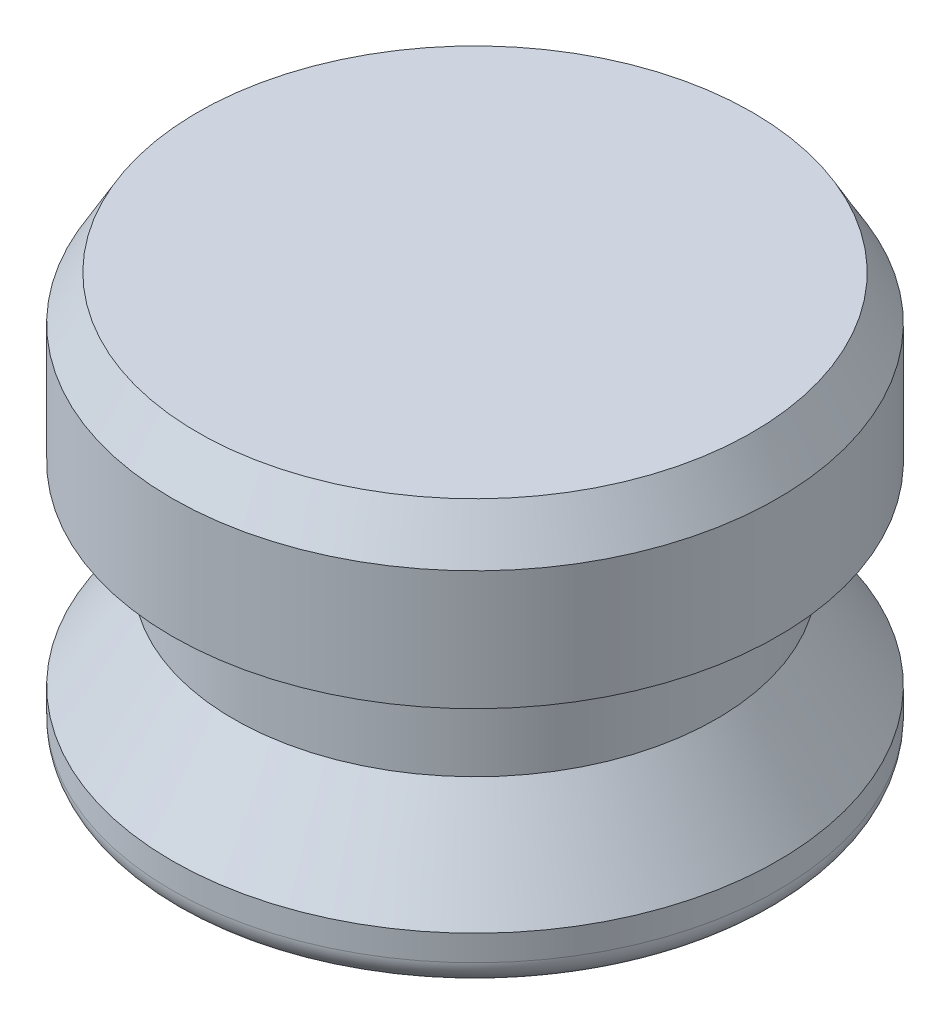
ISO-10303-21;
HEADER;
FILE_DESCRIPTION(('STEP AP214'),'2;1');
FILE_NAME('part.step','',(''),(''),'','','');
FILE_SCHEMA(('AUTOMOTIVE_DESIGN { 1 0 10303 214 1 1 1 1 }'));
ENDSEC;
DATA;
#1=APPLICATION_CONTEXT('core data for automotive mechanical design processes');
#2=APPLICATION_PROTOCOL_DEFINITION('international standard','automotive_design',2000,#1);
#3=PRODUCT_CONTEXT('',#1,'mechanical');
#4=PRODUCT('Part','Part','',(#3));
#5=PRODUCT_RELATED_PRODUCT_CATEGORY('part','',(#4));
#6=PRODUCT_DEFINITION_FORMATION('','',#4);
#7=PRODUCT_DEFINITION_CONTEXT('part definition',#1,'design');
#8=PRODUCT_DEFINITION('design','',#6,#7);
#9=PRODUCT_DEFINITION_SHAPE('','',#8);
#10=(LENGTH_UNIT() NAMED_UNIT(*) SI_UNIT(.MILLI.,.METRE.));
#11=(NAMED_UNIT(*) PLANE_ANGLE_UNIT() SI_UNIT($,.RADIAN.));
#12=(NAMED_UNIT(*) SI_UNIT($,.STERADIAN.) SOLID_ANGLE_UNIT());
#13=UNCERTAINTY_MEASURE_WITH_UNIT(LENGTH_MEASURE(1.E-05),#10,'distance_accuracy_value','');
#14=(GEOMETRIC_REPRESENTATION_CONTEXT(3) GLOBAL_UNCERTAINTY_ASSIGNED_CONTEXT((#13)) GLOBAL_UNIT_ASSIGNED_CONTEXT((#10,
#11,#12)) REPRESENTATION_CONTEXT('',''));
#15=CARTESIAN_POINT('',(0.,0.,0.));
#16=DIRECTION('',(0.,0.,1.));
#17=DIRECTION('',(1.,0.,0.));
#18=AXIS2_PLACEMENT_3D('',#15,#16,#17);
#19=CARTESIAN_POINT('',(0.,0.,0.));
#20=DIRECTION('',(0.,1.,0.));
#21=DIRECTION('',(0.,0.,1.));
#22=AXIS2_PLACEMENT_3D('',#19,#20,#21);
#23=PLANE('',#22);
#24=CARTESIAN_POINT('',(0.,0.,0.));
#25=DIRECTION('',(0.,1.,0.));
#26=DIRECTION('',(0.,0.,1.));
#27=AXIS2_PLACEMENT_3D('',#24,#25,#26);
#28=CIRCLE('',#27,8.60425);
#29=CARTESIAN_POINT('',(0.,0.,8.60425));
#30=VERTEX_POINT('',#29);
#31=EDGE_CURVE('E46',#30,#30,#28,.F.);
#32=ORIENTED_EDGE('',*,*,#31,.T.);
#33=EDGE_LOOP('',(#32));
#34=FACE_BOUND('',#33,.T.);
#35=ADVANCED_FACE('F31',(#34),#23,.F.);
#36=CARTESIAN_POINT('',(0.,0.,0.));
#37=DIRECTION('',(0.,-1.,0.));
#38=DIRECTION('',(0.,0.,-1.));
#39=AXIS2_PLACEMENT_3D('',#36,#37,#38);
#40=CYLINDRICAL_SURFACE('',#39,9.398);
#41=CARTESIAN_POINT('',(0.,0.793749999999999,0.));
#42=DIRECTION('',(0.,1.,0.));
#43=DIRECTION('',(0.,0.,1.));
#44=AXIS2_PLACEMENT_3D('',#41,#42,#43);
#45=CIRCLE('',#44,9.398);
#46=CARTESIAN_POINT('',(0.,0.793749999999999,9.398));
#47=VERTEX_POINT('',#46);
#48=EDGE_CURVE('E42',#47,#47,#45,.T.);
#49=ORIENTED_EDGE('',*,*,#48,.T.);
#50=EDGE_LOOP('',(#49));
#51=FACE_BOUND('',#50,.T.);
#52=CARTESIAN_POINT('',(0.,1.5875,0.));
#53=DIRECTION('',(0.,-1.,0.));
#54=DIRECTION('',(0.,0.,-1.));
#55=AXIS2_PLACEMENT_3D('',#52,#53,#54);
#56=CIRCLE('',#55,9.398);
#57=CARTESIAN_POINT('',(0.,1.5875,-9.398));
#58=VERTEX_POINT('',#57);
#59=EDGE_CURVE('E51',#58,#58,#56,.T.);
#60=ORIENTED_EDGE('',*,*,#59,.T.);
#61=EDGE_LOOP('',(#60));
#62=FACE_BOUND('',#61,.T.);
#63=ADVANCED_FACE('F80',(#51,#62),#40,.T.);
#64=CARTESIAN_POINT('',(0.,4.445,0.));
#65=DIRECTION('',(0.,-1.,0.));
#66=DIRECTION('',(0.,0.,-1.));
#67=AXIS2_PLACEMENT_3D('',#64,#65,#66);
#68=CONICAL_SURFACE('',#67,7.493,0.588002603547568);
#69=ORIENTED_EDGE('',*,*,#59,.F.);
#70=EDGE_LOOP('',(#69));
#71=FACE_BOUND('',#70,.T.);
#72=CARTESIAN_POINT('',(0.,4.445,0.));
#73=DIRECTION('',(0.,-1.,0.));
#74=DIRECTION('',(0.,0.,-1.));
#75=AXIS2_PLACEMENT_3D('',#72,#73,#74);
#76=CIRCLE('',#75,7.493);
#77=CARTESIAN_POINT('',(0.,4.445,-7.493));
#78=VERTEX_POINT('',#77);
#79=EDGE_CURVE('E54',#78,#78,#76,.T.);
#80=ORIENTED_EDGE('',*,*,#79,.T.);
#81=EDGE_LOOP('',(#80));
#82=FACE_BOUND('',#81,.T.);
#83=ADVANCED_FACE('F86',(#71,#82),#68,.T.);
#84=CARTESIAN_POINT('',(0.,0.,0.));
#85=DIRECTION('',(0.,-1.,0.));
#86=DIRECTION('',(0.,0.,-1.));
#87=AXIS2_PLACEMENT_3D('',#84,#85,#86);
#88=CYLINDRICAL_SURFACE('',#87,7.493);
#89=ORIENTED_EDGE('',*,*,#79,.F.);
#90=EDGE_LOOP('',(#89));
#91=FACE_BOUND('',#90,.T.);
#92=CARTESIAN_POINT('',(0.,7.62,0.));
#93=DIRECTION('',(0.,-1.,0.));
#94=DIRECTION('',(0.,0.,-1.));
#95=AXIS2_PLACEMENT_3D('',#92,#93,#94);
#96=CIRCLE('',#95,7.493);
#97=CARTESIAN_POINT('',(0.,7.62,-7.493));
#98=VERTEX_POINT('',#97);
#99=EDGE_CURVE('E57',#98,#98,#96,.T.);
#100=ORIENTED_EDGE('',*,*,#99,.T.);
#101=EDGE_LOOP('',(#100));
#102=FACE_BOUND('',#101,.T.);
#103=ADVANCED_FACE('F76',(#91,#102),#88,.T.);
#104=CARTESIAN_POINT('',(-7.493,7.62,0.));
#105=DIRECTION('',(0.,1.,0.));
#106=DIRECTION('',(0.,0.,1.));
#107=AXIS2_PLACEMENT_3D('',#104,#105,#106);
#108=PLANE('',#107);
#109=ORIENTED_EDGE('',*,*,#99,.F.);
#110=EDGE_LOOP('',(#109));
#111=FACE_BOUND('',#110,.T.);
#112=CARTESIAN_POINT('',(0.,7.62,0.));
#113=DIRECTION('',(0.,-1.,0.));
#114=DIRECTION('',(0.,0.,-1.));
#115=AXIS2_PLACEMENT_3D('',#112,#113,#114);
#116=CIRCLE('',#115,9.398);
#117=CARTESIAN_POINT('',(0.,7.62,-9.398));
#118=VERTEX_POINT('',#117);
#119=EDGE_CURVE('E60',#118,#118,#116,.T.);
#120=ORIENTED_EDGE('',*,*,#119,.T.);
#121=EDGE_LOOP('',(#120));
#122=FACE_BOUND('',#121,.T.);
#123=ADVANCED_FACE('F64',(#111,#122),#108,.F.);
#124=CARTESIAN_POINT('',(0.,0.,0.));
#125=DIRECTION('',(0.,-1.,0.));
#126=DIRECTION('',(0.,0.,-1.));
#127=AXIS2_PLACEMENT_3D('',#124,#125,#126);
#128=CYLINDRICAL_SURFACE('',#127,9.398);
#129=CARTESIAN_POINT('',(0.,11.3251846714922,0.));
#130=DIRECTION('',(0.,-1.,0.));
#131=DIRECTION('',(0.,0.,-1.));
#132=AXIS2_PLACEMENT_3D('',#129,#130,#131);
#133=CIRCLE('',#132,9.398);
#134=CARTESIAN_POINT('',(0.,11.3251846714922,-9.398));
#135=VERTEX_POINT('',#134);
#136=EDGE_CURVE('E38',#135,#135,#133,.T.);
#137=ORIENTED_EDGE('',*,*,#136,.T.);
#138=EDGE_LOOP('',(#137));
#139=FACE_BOUND('',#138,.T.);
#140=ORIENTED_EDGE('',*,*,#119,.F.);
#141=EDGE_LOOP('',(#140));
#142=FACE_BOUND('',#141,.T.);
#143=ADVANCED_FACE('F66',(#139,#142),#128,.T.);
#144=CARTESIAN_POINT('',(-9.398,12.7,0.));
#145=DIRECTION('',(0.,-1.,0.));
#146=DIRECTION('',(0.,0.,-1.));
#147=AXIS2_PLACEMENT_3D('',#144,#145,#146);
#148=PLANE('',#147);
#149=CARTESIAN_POINT('',(0.,12.7,0.));
#150=DIRECTION('',(0.,-1.,0.));
#151=DIRECTION('',(0.,0.,-1.));
#152=AXIS2_PLACEMENT_3D('',#149,#150,#151);
#153=CIRCLE('',#152,8.60424999999999);
#154=CARTESIAN_POINT('',(0.,12.7,-8.60424999999999));
#155=VERTEX_POINT('',#154);
#156=EDGE_CURVE('E10',#155,#155,#153,.F.);
#157=ORIENTED_EDGE('',*,*,#156,.T.);
#158=EDGE_LOOP('',(#157));
#159=FACE_BOUND('',#158,.T.);
#160=ADVANCED_FACE('F68',(#159),#148,.F.);
#161=CARTESIAN_POINT('',(0.,0.793749999999999,0.));
#162=DIRECTION('',(0.,1.,0.));
#163=DIRECTION('',(0.,0.,1.));
#164=AXIS2_PLACEMENT_3D('',#161,#162,#163);
#165=TOROIDAL_SURFACE('',#164,8.60425,0.79375);
#166=ORIENTED_EDGE('',*,*,#48,.F.);
#167=EDGE_LOOP('',(#166));
#168=FACE_BOUND('',#167,.T.);
#169=ORIENTED_EDGE('',*,*,#31,.F.);
#170=EDGE_LOOP('',(#169));
#171=FACE_BOUND('',#170,.T.);
#172=ADVANCED_FACE('F74',(#168,#171),#165,.T.);
#173=CARTESIAN_POINT('',(0.,11.3251846714922,0.));
#174=DIRECTION('',(0.,-1.,0.));
#175=DIRECTION('',(0.,0.,-1.));
#176=AXIS2_PLACEMENT_3D('',#173,#174,#175);
#177=CONICAL_SURFACE('',#176,9.398,0.5235987755983);
#178=ORIENTED_EDGE('',*,*,#156,.F.);
#179=EDGE_LOOP('',(#178));
#180=FACE_BOUND('',#179,.T.);
#181=ORIENTED_EDGE('',*,*,#136,.F.);
#182=EDGE_LOOP('',(#181));
#183=FACE_BOUND('',#182,.T.);
#184=ADVANCED_FACE('F33',(#180,#183),#177,.T.);
#185=CLOSED_SHELL('',(#35,#63,#83,#103,#123,#143,#160,#172,#184));
#186=MANIFOLD_SOLID_BREP('B2',#185);
#187=ADVANCED_BREP_SHAPE_REPRESENTATION('',(#18,#186),#14);
#188=SHAPE_DEFINITION_REPRESENTATION(#9,#187);
ENDSEC;
END-ISO-10303-21;
